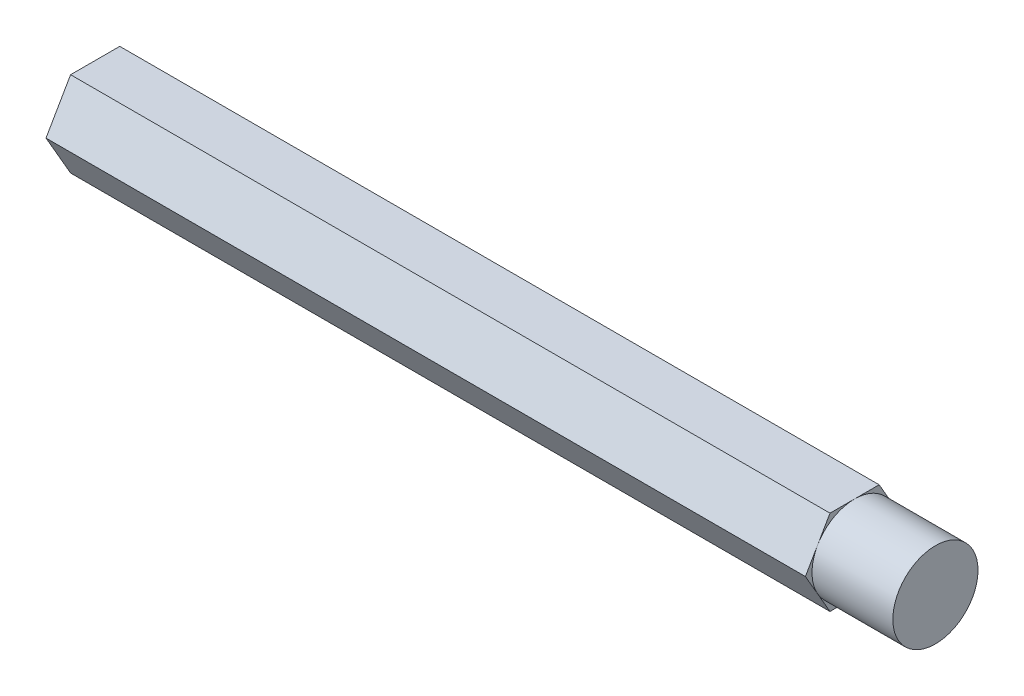
ISO-10303-21;
HEADER;
FILE_DESCRIPTION(('STEP AP214'),'2;1');
FILE_NAME('part.step','',(''),(''),'','','');
FILE_SCHEMA(('AUTOMOTIVE_DESIGN { 1 0 10303 214 1 1 1 1 }'));
ENDSEC;
DATA;
#1=APPLICATION_CONTEXT('core data for automotive mechanical design processes');
#2=APPLICATION_PROTOCOL_DEFINITION('international standard','automotive_design',2000,#1);
#3=PRODUCT_CONTEXT('',#1,'mechanical');
#4=PRODUCT('Part','Part','',(#3));
#5=PRODUCT_RELATED_PRODUCT_CATEGORY('part','',(#4));
#6=PRODUCT_DEFINITION_FORMATION('','',#4);
#7=PRODUCT_DEFINITION_CONTEXT('part definition',#1,'design');
#8=PRODUCT_DEFINITION('design','',#6,#7);
#9=PRODUCT_DEFINITION_SHAPE('','',#8);
#10=(LENGTH_UNIT() NAMED_UNIT(*) SI_UNIT(.MILLI.,.METRE.));
#11=(NAMED_UNIT(*) PLANE_ANGLE_UNIT() SI_UNIT($,.RADIAN.));
#12=(NAMED_UNIT(*) SI_UNIT($,.STERADIAN.) SOLID_ANGLE_UNIT());
#13=UNCERTAINTY_MEASURE_WITH_UNIT(LENGTH_MEASURE(1.E-05),#10,'distance_accuracy_value','');
#14=(GEOMETRIC_REPRESENTATION_CONTEXT(3) GLOBAL_UNCERTAINTY_ASSIGNED_CONTEXT((#13)) GLOBAL_UNIT_ASSIGNED_CONTEXT((#10,
#11,#12)) REPRESENTATION_CONTEXT('',''));
#15=CARTESIAN_POINT('',(0.,0.,0.));
#16=DIRECTION('',(0.,0.,1.));
#17=DIRECTION('',(1.,0.,0.));
#18=AXIS2_PLACEMENT_3D('',#15,#16,#17);
#19=CARTESIAN_POINT('',(93.98,4.7625,2.7496306570156));
#20=DIRECTION('',(0.,-0.5,-0.866025403784439));
#21=DIRECTION('',(0.,0.866025403784439,-0.5));
#22=AXIS2_PLACEMENT_3D('',#19,#20,#21);
#23=PLANE('',#22);
#24=DIRECTION('',(0.,-0.866025403784439,0.5));
#25=VECTOR('',#24,1.);
#26=CARTESIAN_POINT('',(84.9376,4.7625,2.7496306570156));
#27=LINE('',#26,#25);
#28=CARTESIAN_POINT('',(84.9376,4.7625,2.7496306570156));
#29=VERTEX_POINT('',#28);
#30=CARTESIAN_POINT('',(84.9376,2.38125,4.12444598552339));
#31=VERTEX_POINT('',#30);
#32=EDGE_CURVE('E147',#29,#31,#27,.T.);
#33=ORIENTED_EDGE('',*,*,#32,.F.);
#34=DIRECTION('',(-1.,0.,0.));
#35=VECTOR('',#34,1.);
#36=CARTESIAN_POINT('',(93.98,4.7625,2.7496306570156));
#37=LINE('',#36,#35);
#38=CARTESIAN_POINT('',(0.,4.7625,2.7496306570156));
#39=VERTEX_POINT('',#38);
#40=EDGE_CURVE('E59',#29,#39,#37,.T.);
#41=ORIENTED_EDGE('',*,*,#40,.T.);
#42=DIRECTION('',(0.,-0.866025403784439,0.5));
#43=VECTOR('',#42,1.);
#44=CARTESIAN_POINT('',(0.,4.7625,2.7496306570156));
#45=LINE('',#44,#43);
#46=CARTESIAN_POINT('',(0.,0.,5.49926131403119));
#47=VERTEX_POINT('',#46);
#48=EDGE_CURVE('E148',#39,#47,#45,.T.);
#49=ORIENTED_EDGE('',*,*,#48,.T.);
#50=DIRECTION('',(-1.,0.,0.));
#51=VECTOR('',#50,1.);
#52=CARTESIAN_POINT('',(93.98,0.,5.49926131403119));
#53=LINE('',#52,#51);
#54=CARTESIAN_POINT('',(84.9376,0.,5.49926131403119));
#55=VERTEX_POINT('',#54);
#56=EDGE_CURVE('E171',#55,#47,#53,.T.);
#57=ORIENTED_EDGE('',*,*,#56,.F.);
#58=EDGE_CURVE('E145',#31,#55,#27,.T.);
#59=ORIENTED_EDGE('',*,*,#58,.F.);
#60=EDGE_LOOP('',(#33,#41,#49,#57,#59));
#61=FACE_BOUND('',#60,.T.);
#62=ADVANCED_FACE('F37',(#61),#23,.F.);
#63=CARTESIAN_POINT('',(93.98,0.,5.49926131403119));
#64=DIRECTION('',(0.,0.5,-0.866025403784439));
#65=DIRECTION('',(0.,0.866025403784439,0.5));
#66=AXIS2_PLACEMENT_3D('',#63,#64,#65);
#67=PLANE('',#66);
#68=DIRECTION('',(0.,-0.866025403784439,-0.5));
#69=VECTOR('',#68,1.);
#70=CARTESIAN_POINT('',(84.9376,0.,5.49926131403119));
#71=LINE('',#70,#69);
#72=CARTESIAN_POINT('',(84.9376,-2.38125,4.12444598552339));
#73=VERTEX_POINT('',#72);
#74=EDGE_CURVE('E144',#55,#73,#71,.T.);
#75=ORIENTED_EDGE('',*,*,#74,.F.);
#76=ORIENTED_EDGE('',*,*,#56,.T.);
#77=DIRECTION('',(0.,-0.866025403784439,-0.5));
#78=VECTOR('',#77,1.);
#79=CARTESIAN_POINT('',(0.,0.,5.49926131403119));
#80=LINE('',#79,#78);
#81=CARTESIAN_POINT('',(0.,-4.7625,2.7496306570156));
#82=VERTEX_POINT('',#81);
#83=EDGE_CURVE('E150',#47,#82,#80,.T.);
#84=ORIENTED_EDGE('',*,*,#83,.T.);
#85=DIRECTION('',(-1.,0.,0.));
#86=VECTOR('',#85,1.);
#87=CARTESIAN_POINT('',(93.98,-4.7625,2.7496306570156));
#88=LINE('',#87,#86);
#89=CARTESIAN_POINT('',(84.9376,-4.7625,2.74963065701561));
#90=VERTEX_POINT('',#89);
#91=EDGE_CURVE('E169',#90,#82,#88,.T.);
#92=ORIENTED_EDGE('',*,*,#91,.F.);
#93=EDGE_CURVE('E142',#73,#90,#71,.T.);
#94=ORIENTED_EDGE('',*,*,#93,.F.);
#95=EDGE_LOOP('',(#75,#76,#84,#92,#94));
#96=FACE_BOUND('',#95,.T.);
#97=ADVANCED_FACE('F192',(#96),#67,.F.);
#98=CARTESIAN_POINT('',(93.98,-4.7625,2.7496306570156));
#99=DIRECTION('',(0.,1.,0.));
#100=DIRECTION('',(0.,0.,1.));
#101=AXIS2_PLACEMENT_3D('',#98,#99,#100);
#102=PLANE('',#101);
#103=DIRECTION('',(0.,0.,-1.));
#104=VECTOR('',#103,1.);
#105=CARTESIAN_POINT('',(84.9376,-4.7625,2.7496306570156));
#106=LINE('',#105,#104);
#107=CARTESIAN_POINT('',(84.9376,-4.7625,0.));
#108=VERTEX_POINT('',#107);
#109=EDGE_CURVE('E141',#90,#108,#106,.T.);
#110=ORIENTED_EDGE('',*,*,#109,.F.);
#111=ORIENTED_EDGE('',*,*,#91,.T.);
#112=DIRECTION('',(0.,0.,-1.));
#113=VECTOR('',#112,1.);
#114=CARTESIAN_POINT('',(0.,-4.7625,2.7496306570156));
#115=LINE('',#114,#113);
#116=CARTESIAN_POINT('',(0.,-4.7625,-2.74963065701559));
#117=VERTEX_POINT('',#116);
#118=EDGE_CURVE('E153',#82,#117,#115,.T.);
#119=ORIENTED_EDGE('',*,*,#118,.T.);
#120=DIRECTION('',(-1.,0.,0.));
#121=VECTOR('',#120,1.);
#122=CARTESIAN_POINT('',(93.98,-4.7625,-2.74963065701559));
#123=LINE('',#122,#121);
#124=CARTESIAN_POINT('',(84.9376,-4.76250000000002,-2.74963065701558));
#125=VERTEX_POINT('',#124);
#126=EDGE_CURVE('E167',#125,#117,#123,.T.);
#127=ORIENTED_EDGE('',*,*,#126,.F.);
#128=EDGE_CURVE('E139',#108,#125,#106,.T.);
#129=ORIENTED_EDGE('',*,*,#128,.F.);
#130=EDGE_LOOP('',(#110,#111,#119,#127,#129));
#131=FACE_BOUND('',#130,.T.);
#132=ADVANCED_FACE('F207',(#131),#102,.F.);
#133=CARTESIAN_POINT('',(93.98,-4.7625,-2.74963065701559));
#134=DIRECTION('',(0.,0.5,0.866025403784439));
#135=DIRECTION('',(0.,-0.866025403784439,0.5));
#136=AXIS2_PLACEMENT_3D('',#133,#134,#135);
#137=PLANE('',#136);
#138=DIRECTION('',(0.,0.866025403784439,-0.5));
#139=VECTOR('',#138,1.);
#140=CARTESIAN_POINT('',(84.9376,-4.7625,-2.74963065701559));
#141=LINE('',#140,#139);
#142=CARTESIAN_POINT('',(84.9376,-2.38125,-4.12444598552339));
#143=VERTEX_POINT('',#142);
#144=EDGE_CURVE('E138',#125,#143,#141,.T.);
#145=ORIENTED_EDGE('',*,*,#144,.F.);
#146=ORIENTED_EDGE('',*,*,#126,.T.);
#147=DIRECTION('',(0.,0.866025403784439,-0.5));
#148=VECTOR('',#147,1.);
#149=CARTESIAN_POINT('',(0.,-4.7625,-2.74963065701559));
#150=LINE('',#149,#148);
#151=CARTESIAN_POINT('',(0.,0.,-5.49926131403118));
#152=VERTEX_POINT('',#151);
#153=EDGE_CURVE('E156',#117,#152,#150,.T.);
#154=ORIENTED_EDGE('',*,*,#153,.T.);
#155=DIRECTION('',(-1.,0.,0.));
#156=VECTOR('',#155,1.);
#157=CARTESIAN_POINT('',(93.98,0.,-5.49926131403118));
#158=LINE('',#157,#156);
#159=CARTESIAN_POINT('',(84.9376,0.,-5.49926131403119));
#160=VERTEX_POINT('',#159);
#161=EDGE_CURVE('E165',#160,#152,#158,.T.);
#162=ORIENTED_EDGE('',*,*,#161,.F.);
#163=EDGE_CURVE('E116',#143,#160,#141,.T.);
#164=ORIENTED_EDGE('',*,*,#163,.F.);
#165=EDGE_LOOP('',(#145,#146,#154,#162,#164));
#166=FACE_BOUND('',#165,.T.);
#167=ADVANCED_FACE('F212',(#166),#137,.F.);
#168=CARTESIAN_POINT('',(93.98,0.,-5.49926131403118));
#169=DIRECTION('',(0.,-0.5,0.866025403784439));
#170=DIRECTION('',(0.,-0.866025403784439,-0.5));
#171=AXIS2_PLACEMENT_3D('',#168,#169,#170);
#172=PLANE('',#171);
#173=DIRECTION('',(0.,0.866025403784439,0.5));
#174=VECTOR('',#173,1.);
#175=CARTESIAN_POINT('',(84.9376,0.,-5.49926131403118));
#176=LINE('',#175,#174);
#177=CARTESIAN_POINT('',(84.9376,2.38125,-4.12444598552339));
#178=VERTEX_POINT('',#177);
#179=EDGE_CURVE('E111',#160,#178,#176,.T.);
#180=ORIENTED_EDGE('',*,*,#179,.F.);
#181=ORIENTED_EDGE('',*,*,#161,.T.);
#182=DIRECTION('',(0.,0.866025403784439,0.5));
#183=VECTOR('',#182,1.);
#184=CARTESIAN_POINT('',(0.,0.,-5.49926131403118));
#185=LINE('',#184,#183);
#186=CARTESIAN_POINT('',(0.,4.7625,-2.74963065701559));
#187=VERTEX_POINT('',#186);
#188=EDGE_CURVE('E159',#152,#187,#185,.T.);
#189=ORIENTED_EDGE('',*,*,#188,.T.);
#190=DIRECTION('',(-1.,0.,0.));
#191=VECTOR('',#190,1.);
#192=CARTESIAN_POINT('',(93.98,4.7625,-2.74963065701559));
#193=LINE('',#192,#191);
#194=CARTESIAN_POINT('',(84.9376,4.7625,-2.7496306570156));
#195=VERTEX_POINT('',#194);
#196=EDGE_CURVE('E135',#195,#187,#193,.T.);
#197=ORIENTED_EDGE('',*,*,#196,.F.);
#198=EDGE_CURVE('E120',#178,#195,#176,.T.);
#199=ORIENTED_EDGE('',*,*,#198,.F.);
#200=EDGE_LOOP('',(#180,#181,#189,#197,#199));
#201=FACE_BOUND('',#200,.T.);
#202=ADVANCED_FACE('F133',(#201),#172,.F.);
#203=CARTESIAN_POINT('',(93.98,4.7625,-2.74963065701559));
#204=DIRECTION('',(0.,-1.,0.));
#205=DIRECTION('',(0.,0.,-1.));
#206=AXIS2_PLACEMENT_3D('',#203,#204,#205);
#207=PLANE('',#206);
#208=DIRECTION('',(0.,0.,1.));
#209=VECTOR('',#208,1.);
#210=CARTESIAN_POINT('',(84.9376,4.7625,-2.74963065701559));
#211=LINE('',#210,#209);
#212=CARTESIAN_POINT('',(84.9376,4.7625,0.));
#213=VERTEX_POINT('',#212);
#214=EDGE_CURVE('E11',#195,#213,#211,.T.);
#215=ORIENTED_EDGE('',*,*,#214,.F.);
#216=ORIENTED_EDGE('',*,*,#196,.T.);
#217=DIRECTION('',(0.,0.,1.));
#218=VECTOR('',#217,1.);
#219=CARTESIAN_POINT('',(0.,4.7625,-2.74963065701559));
#220=LINE('',#219,#218);
#221=EDGE_CURVE('E161',#187,#39,#220,.T.);
#222=ORIENTED_EDGE('',*,*,#221,.T.);
#223=ORIENTED_EDGE('',*,*,#40,.F.);
#224=EDGE_CURVE('E40',#213,#29,#211,.T.);
#225=ORIENTED_EDGE('',*,*,#224,.F.);
#226=EDGE_LOOP('',(#215,#216,#222,#223,#225));
#227=FACE_BOUND('',#226,.T.);
#228=ADVANCED_FACE('F182',(#227),#207,.F.);
#229=CARTESIAN_POINT('',(0.,0.,0.));
#230=DIRECTION('',(1.,0.,0.));
#231=DIRECTION('',(0.,0.,-1.));
#232=AXIS2_PLACEMENT_3D('',#229,#230,#231);
#233=PLANE('',#232);
#234=ORIENTED_EDGE('',*,*,#48,.F.);
#235=ORIENTED_EDGE('',*,*,#221,.F.);
#236=ORIENTED_EDGE('',*,*,#188,.F.);
#237=ORIENTED_EDGE('',*,*,#153,.F.);
#238=ORIENTED_EDGE('',*,*,#118,.F.);
#239=ORIENTED_EDGE('',*,*,#83,.F.);
#240=EDGE_LOOP('',(#234,#235,#236,#237,#238,#239));
#241=FACE_BOUND('',#240,.T.);
#242=ADVANCED_FACE('F188',(#241),#233,.F.);
#243=CARTESIAN_POINT('',(84.9376,0.,0.));
#244=DIRECTION('',(1.,0.,0.));
#245=DIRECTION('',(0.,0.,-1.));
#246=AXIS2_PLACEMENT_3D('',#243,#244,#245);
#247=PLANE('',#246);
#248=ORIENTED_EDGE('',*,*,#32,.T.);
#249=CARTESIAN_POINT('',(84.9376,0.,0.));
#250=DIRECTION('',(1.,0.,0.));
#251=DIRECTION('',(0.,0.,-1.));
#252=AXIS2_PLACEMENT_3D('',#249,#250,#251);
#253=CIRCLE('',#252,4.7625);
#254=EDGE_CURVE('E131',#213,#31,#253,.T.);
#255=ORIENTED_EDGE('',*,*,#254,.F.);
#256=ORIENTED_EDGE('',*,*,#224,.T.);
#257=EDGE_LOOP('',(#248,#255,#256));
#258=FACE_BOUND('',#257,.T.);
#259=ADVANCED_FACE('F177',(#258),#247,.T.);
#260=ORIENTED_EDGE('',*,*,#58,.T.);
#261=ORIENTED_EDGE('',*,*,#74,.T.);
#262=EDGE_CURVE('E199',#31,#73,#253,.T.);
#263=ORIENTED_EDGE('',*,*,#262,.F.);
#264=EDGE_LOOP('',(#260,#261,#263));
#265=FACE_BOUND('',#264,.T.);
#266=ADVANCED_FACE('F197',(#265),#247,.T.);
#267=ORIENTED_EDGE('',*,*,#93,.T.);
#268=ORIENTED_EDGE('',*,*,#109,.T.);
#269=EDGE_CURVE('E201',#73,#108,#253,.T.);
#270=ORIENTED_EDGE('',*,*,#269,.F.);
#271=EDGE_LOOP('',(#267,#268,#270));
#272=FACE_BOUND('',#271,.T.);
#273=ADVANCED_FACE('F202',(#272),#247,.T.);
#274=ORIENTED_EDGE('',*,*,#128,.T.);
#275=ORIENTED_EDGE('',*,*,#144,.T.);
#276=EDGE_CURVE('E125',#108,#143,#253,.T.);
#277=ORIENTED_EDGE('',*,*,#276,.F.);
#278=EDGE_LOOP('',(#274,#275,#277));
#279=FACE_BOUND('',#278,.T.);
#280=ADVANCED_FACE('F210',(#279),#247,.T.);
#281=ORIENTED_EDGE('',*,*,#163,.T.);
#282=ORIENTED_EDGE('',*,*,#179,.T.);
#283=EDGE_CURVE('E113',#143,#178,#253,.T.);
#284=ORIENTED_EDGE('',*,*,#283,.F.);
#285=EDGE_LOOP('',(#281,#282,#284));
#286=FACE_BOUND('',#285,.T.);
#287=ADVANCED_FACE('F112',(#286),#247,.T.);
#288=ORIENTED_EDGE('',*,*,#198,.T.);
#289=ORIENTED_EDGE('',*,*,#214,.T.);
#290=EDGE_CURVE('E51',#178,#213,#253,.T.);
#291=ORIENTED_EDGE('',*,*,#290,.F.);
#292=EDGE_LOOP('',(#288,#289,#291));
#293=FACE_BOUND('',#292,.T.);
#294=ADVANCED_FACE('F128',(#293),#247,.T.);
#295=CARTESIAN_POINT('',(84.9376,0.,0.));
#296=DIRECTION('',(1.,0.,0.));
#297=DIRECTION('',(0.,0.,-1.));
#298=AXIS2_PLACEMENT_3D('',#295,#296,#297);
#299=CYLINDRICAL_SURFACE('',#298,4.7625);
#300=CARTESIAN_POINT('',(93.98,0.,0.));
#301=DIRECTION('',(1.,0.,0.));
#302=DIRECTION('',(0.,0.,-1.));
#303=AXIS2_PLACEMENT_3D('',#300,#301,#302);
#304=CIRCLE('',#303,4.7625);
#305=CARTESIAN_POINT('',(93.98,0.,-4.7625));
#306=VERTEX_POINT('',#305);
#307=EDGE_CURVE('E172',#306,#306,#304,.T.);
#308=ORIENTED_EDGE('',*,*,#307,.F.);
#309=EDGE_LOOP('',(#308));
#310=FACE_BOUND('',#309,.T.);
#311=ORIENTED_EDGE('',*,*,#254,.T.);
#312=ORIENTED_EDGE('',*,*,#262,.T.);
#313=ORIENTED_EDGE('',*,*,#269,.T.);
#314=ORIENTED_EDGE('',*,*,#276,.T.);
#315=ORIENTED_EDGE('',*,*,#283,.T.);
#316=ORIENTED_EDGE('',*,*,#290,.T.);
#317=EDGE_LOOP('',(#311,#312,#313,#314,#315,#316));
#318=FACE_BOUND('',#317,.T.);
#319=ADVANCED_FACE('F122',(#310,#318),#299,.T.);
#320=CARTESIAN_POINT('',(93.98,0.,0.));
#321=DIRECTION('',(1.,0.,0.));
#322=DIRECTION('',(0.,0.,-1.));
#323=AXIS2_PLACEMENT_3D('',#320,#321,#322);
#324=PLANE('',#323);
#325=ORIENTED_EDGE('',*,*,#307,.T.);
#326=EDGE_LOOP('',(#325));
#327=FACE_BOUND('',#326,.T.);
#328=ADVANCED_FACE('F305',(#327),#324,.T.);
#329=CLOSED_SHELL('',(#62,#97,#132,#167,#202,#228,#242,#259,#266,#273,#280,#287,#294,#319,#328));
#330=MANIFOLD_SOLID_BREP('B2',#329);
#331=ADVANCED_BREP_SHAPE_REPRESENTATION('',(#18,#330),#14);
#332=SHAPE_DEFINITION_REPRESENTATION(#9,#331);
ENDSEC;
END-ISO-10303-21;
